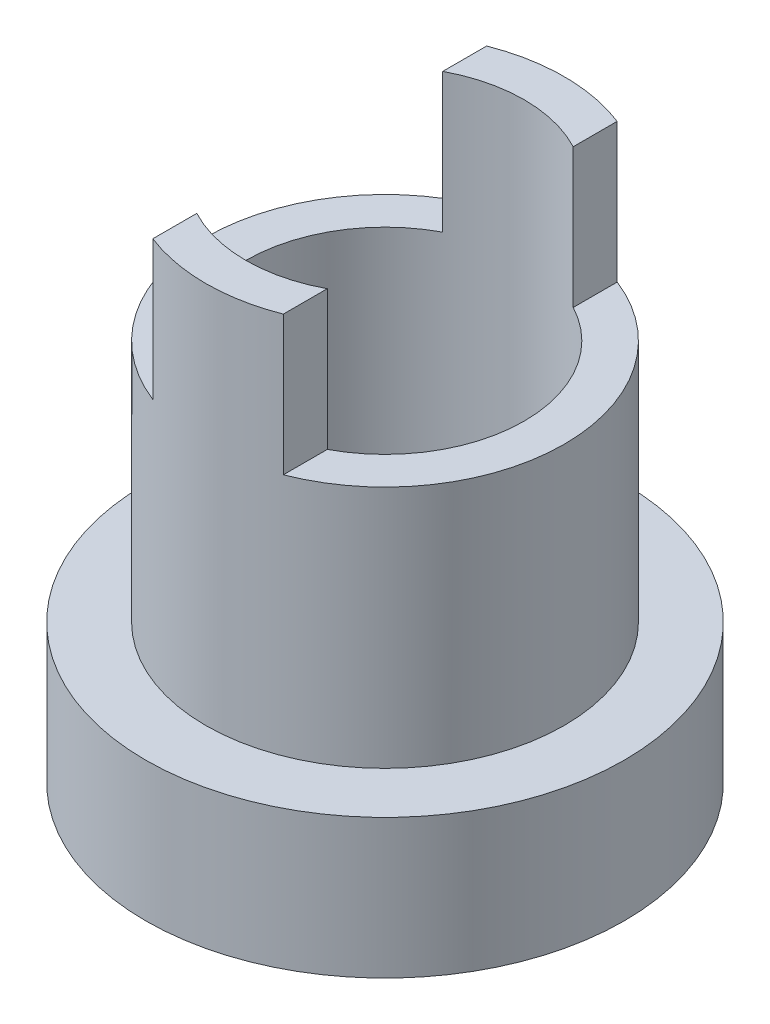
ISO-10303-21;
HEADER;
FILE_DESCRIPTION(('STEP AP214'),'2;1');
FILE_NAME('part.step','',(''),(''),'','','');
FILE_SCHEMA(('AUTOMOTIVE_DESIGN { 1 0 10303 214 1 1 1 1 }'));
ENDSEC;
DATA;
#1=APPLICATION_CONTEXT('core data for automotive mechanical design processes');
#2=APPLICATION_PROTOCOL_DEFINITION('international standard','automotive_design',2000,#1);
#3=PRODUCT_CONTEXT('',#1,'mechanical');
#4=PRODUCT('Part','Part','',(#3));
#5=PRODUCT_RELATED_PRODUCT_CATEGORY('part','',(#4));
#6=PRODUCT_DEFINITION_FORMATION('','',#4);
#7=PRODUCT_DEFINITION_CONTEXT('part definition',#1,'design');
#8=PRODUCT_DEFINITION('design','',#6,#7);
#9=PRODUCT_DEFINITION_SHAPE('','',#8);
#10=(LENGTH_UNIT() NAMED_UNIT(*) SI_UNIT(.MILLI.,.METRE.));
#11=(NAMED_UNIT(*) PLANE_ANGLE_UNIT() SI_UNIT($,.RADIAN.));
#12=(NAMED_UNIT(*) SI_UNIT($,.STERADIAN.) SOLID_ANGLE_UNIT());
#13=UNCERTAINTY_MEASURE_WITH_UNIT(LENGTH_MEASURE(1.E-05),#10,'distance_accuracy_value','');
#14=(GEOMETRIC_REPRESENTATION_CONTEXT(3) GLOBAL_UNCERTAINTY_ASSIGNED_CONTEXT((#13)) GLOBAL_UNIT_ASSIGNED_CONTEXT((#10,
#11,#12)) REPRESENTATION_CONTEXT('',''));
#15=CARTESIAN_POINT('',(0.,0.,0.));
#16=DIRECTION('',(0.,0.,1.));
#17=DIRECTION('',(1.,0.,0.));
#18=AXIS2_PLACEMENT_3D('',#15,#16,#17);
#19=CARTESIAN_POINT('',(0.,4.,0.));
#20=DIRECTION('',(0.,1.,0.));
#21=DIRECTION('',(0.,0.,1.));
#22=AXIS2_PLACEMENT_3D('',#19,#20,#21);
#23=PLANE('',#22);
#24=CARTESIAN_POINT('',(0.,4.,0.));
#25=DIRECTION('',(0.,1.,0.));
#26=DIRECTION('',(0.,0.,1.));
#27=AXIS2_PLACEMENT_3D('',#24,#25,#26);
#28=CIRCLE('',#27,5.15);
#29=CARTESIAN_POINT('',(0.,4.,5.15));
#30=VERTEX_POINT('',#29);
#31=EDGE_CURVE('E19',#30,#30,#28,.T.);
#32=ORIENTED_EDGE('',*,*,#31,.F.);
#33=EDGE_LOOP('',(#32));
#34=FACE_BOUND('',#33,.T.);
#35=CARTESIAN_POINT('',(0.,4.,0.));
#36=DIRECTION('',(0.,1.,0.));
#37=DIRECTION('',(0.,0.,1.));
#38=AXIS2_PLACEMENT_3D('',#35,#36,#37);
#39=CIRCLE('',#38,6.875);
#40=CARTESIAN_POINT('',(0.,4.,6.875));
#41=VERTEX_POINT('',#40);
#42=EDGE_CURVE('E89',#41,#41,#39,.F.);
#43=ORIENTED_EDGE('',*,*,#42,.F.);
#44=EDGE_LOOP('',(#43));
#45=FACE_BOUND('',#44,.T.);
#46=ADVANCED_FACE('F16',(#34,#45),#23,.T.);
#47=CARTESIAN_POINT('',(0.,4.,0.));
#48=DIRECTION('',(0.,1.,0.));
#49=DIRECTION('',(0.,0.,1.));
#50=AXIS2_PLACEMENT_3D('',#47,#48,#49);
#51=CYLINDRICAL_SURFACE('',#50,5.15);
#52=ORIENTED_EDGE('',*,*,#31,.T.);
#53=EDGE_LOOP('',(#52));
#54=FACE_BOUND('',#53,.T.);
#55=DIRECTION('',(0.,1.,0.));
#56=VECTOR('',#55,1.);
#57=CARTESIAN_POINT('',(1.875,13.,4.7965482380562));
#58=LINE('',#57,#56);
#59=CARTESIAN_POINT('',(1.875,15.,4.7965482380562));
#60=VERTEX_POINT('',#59);
#61=CARTESIAN_POINT('',(1.875,11.,4.7965482380562));
#62=VERTEX_POINT('',#61);
#63=EDGE_CURVE('E106',#60,#62,#58,.F.);
#64=ORIENTED_EDGE('',*,*,#63,.F.);
#65=CARTESIAN_POINT('',(0.,15.,0.));
#66=DIRECTION('',(0.,1.,0.));
#67=DIRECTION('',(0.,0.,1.));
#68=AXIS2_PLACEMENT_3D('',#65,#66,#67);
#69=CIRCLE('',#68,5.15);
#70=CARTESIAN_POINT('',(-1.875,15.,4.7965482380562));
#71=VERTEX_POINT('',#70);
#72=EDGE_CURVE('E97',#71,#60,#69,.T.);
#73=ORIENTED_EDGE('',*,*,#72,.F.);
#74=DIRECTION('',(0.,1.,0.));
#75=VECTOR('',#74,1.);
#76=CARTESIAN_POINT('',(-1.875,13.,4.7965482380562));
#77=LINE('',#76,#75);
#78=CARTESIAN_POINT('',(-1.875,11.,4.7965482380562));
#79=VERTEX_POINT('',#78);
#80=EDGE_CURVE('E92',#71,#79,#77,.F.);
#81=ORIENTED_EDGE('',*,*,#80,.T.);
#82=CARTESIAN_POINT('',(0.,11.,0.));
#83=DIRECTION('',(0.,1.,0.));
#84=DIRECTION('',(0.,0.,1.));
#85=AXIS2_PLACEMENT_3D('',#82,#83,#84);
#86=CIRCLE('',#85,5.15);
#87=CARTESIAN_POINT('',(-1.875,11.,-4.7965482380562));
#88=VERTEX_POINT('',#87);
#89=EDGE_CURVE('E80',#79,#88,#86,.F.);
#90=ORIENTED_EDGE('',*,*,#89,.T.);
#91=DIRECTION('',(0.,1.,0.));
#92=VECTOR('',#91,1.);
#93=CARTESIAN_POINT('',(-1.875,13.,-4.7965482380562));
#94=LINE('',#93,#92);
#95=CARTESIAN_POINT('',(-1.875,15.,-4.7965482380562));
#96=VERTEX_POINT('',#95);
#97=EDGE_CURVE('E114',#88,#96,#94,.T.);
#98=ORIENTED_EDGE('',*,*,#97,.T.);
#99=CARTESIAN_POINT('',(0.,15.,0.));
#100=DIRECTION('',(0.,1.,0.));
#101=DIRECTION('',(0.,0.,1.));
#102=AXIS2_PLACEMENT_3D('',#99,#100,#101);
#103=CIRCLE('',#102,5.15);
#104=CARTESIAN_POINT('',(1.875,15.,-4.7965482380562));
#105=VERTEX_POINT('',#104);
#106=EDGE_CURVE('E113',#105,#96,#103,.T.);
#107=ORIENTED_EDGE('',*,*,#106,.F.);
#108=DIRECTION('',(0.,1.,0.));
#109=VECTOR('',#108,1.);
#110=CARTESIAN_POINT('',(1.875,13.,-4.7965482380562));
#111=LINE('',#110,#109);
#112=CARTESIAN_POINT('',(1.875,11.,-4.7965482380562));
#113=VERTEX_POINT('',#112);
#114=EDGE_CURVE('E110',#113,#105,#111,.T.);
#115=ORIENTED_EDGE('',*,*,#114,.F.);
#116=CARTESIAN_POINT('',(0.,11.,0.));
#117=DIRECTION('',(0.,1.,0.));
#118=DIRECTION('',(0.,0.,1.));
#119=AXIS2_PLACEMENT_3D('',#116,#117,#118);
#120=CIRCLE('',#119,5.15);
#121=EDGE_CURVE('E109',#113,#62,#120,.F.);
#122=ORIENTED_EDGE('',*,*,#121,.T.);
#123=EDGE_LOOP('',(#64,#73,#81,#90,#98,#107,#115,#122));
#124=FACE_BOUND('',#123,.T.);
#125=ADVANCED_FACE('F96',(#54,#124),#51,.T.);
#126=CARTESIAN_POINT('',(0.,0.,0.));
#127=DIRECTION('',(0.,1.,0.));
#128=DIRECTION('',(0.,0.,1.));
#129=AXIS2_PLACEMENT_3D('',#126,#127,#128);
#130=CYLINDRICAL_SURFACE('',#129,6.875);
#131=CARTESIAN_POINT('',(0.,0.,0.));
#132=DIRECTION('',(0.,1.,0.));
#133=DIRECTION('',(0.,0.,1.));
#134=AXIS2_PLACEMENT_3D('',#131,#132,#133);
#135=CIRCLE('',#134,6.875);
#136=CARTESIAN_POINT('',(0.,0.,6.875));
#137=VERTEX_POINT('',#136);
#138=EDGE_CURVE('E98',#137,#137,#135,.T.);
#139=ORIENTED_EDGE('',*,*,#138,.T.);
#140=EDGE_LOOP('',(#139));
#141=FACE_BOUND('',#140,.T.);
#142=ORIENTED_EDGE('',*,*,#42,.T.);
#143=EDGE_LOOP('',(#142));
#144=FACE_BOUND('',#143,.T.);
#145=ADVANCED_FACE('F148',(#141,#144),#130,.T.);
#146=CARTESIAN_POINT('',(-1.875,11.,-6.23674060833547));
#147=DIRECTION('',(0.,-1.,0.));
#148=DIRECTION('',(0.,0.,-1.));
#149=AXIS2_PLACEMENT_3D('',#146,#147,#148);
#150=PLANE('',#149);
#151=DIRECTION('',(0.,0.,-1.));
#152=VECTOR('',#151,1.);
#153=CARTESIAN_POINT('',(-1.875,11.,-0.0726574679316326));
#154=LINE('',#153,#152);
#155=CARTESIAN_POINT('',(-1.875,11.,3.53332350627564));
#156=VERTEX_POINT('',#155);
#157=EDGE_CURVE('E84',#79,#156,#154,.T.);
#158=ORIENTED_EDGE('',*,*,#157,.T.);
#159=CARTESIAN_POINT('',(0.,11.,0.));
#160=DIRECTION('',(0.,1.,0.));
#161=DIRECTION('',(0.,0.,1.));
#162=AXIS2_PLACEMENT_3D('',#159,#160,#161);
#163=CIRCLE('',#162,4.);
#164=CARTESIAN_POINT('',(-1.875,11.,-3.53332350627564));
#165=VERTEX_POINT('',#164);
#166=EDGE_CURVE('E101',#156,#165,#163,.F.);
#167=ORIENTED_EDGE('',*,*,#166,.T.);
#168=DIRECTION('',(0.,0.,-1.));
#169=VECTOR('',#168,1.);
#170=CARTESIAN_POINT('',(-1.875,11.,-0.0726574679316326));
#171=LINE('',#170,#169);
#172=EDGE_CURVE('E85',#165,#88,#171,.T.);
#173=ORIENTED_EDGE('',*,*,#172,.T.);
#174=ORIENTED_EDGE('',*,*,#89,.F.);
#175=EDGE_LOOP('',(#158,#167,#173,#174));
#176=FACE_BOUND('',#175,.T.);
#177=ADVANCED_FACE('F82',(#176),#150,.F.);
#178=CARTESIAN_POINT('',(-1.875,13.,-0.0726574679316326));
#179=DIRECTION('',(1.,0.,0.));
#180=DIRECTION('',(0.,0.,-1.));
#181=AXIS2_PLACEMENT_3D('',#178,#179,#180);
#182=PLANE('',#181);
#183=ORIENTED_EDGE('',*,*,#172,.F.);
#184=DIRECTION('',(0.,1.,0.));
#185=VECTOR('',#184,1.);
#186=CARTESIAN_POINT('',(-1.875,0.,-3.53332350627564));
#187=LINE('',#186,#185);
#188=CARTESIAN_POINT('',(-1.875,15.,-3.53332350627564));
#189=VERTEX_POINT('',#188);
#190=EDGE_CURVE('E128',#165,#189,#187,.T.);
#191=ORIENTED_EDGE('',*,*,#190,.T.);
#192=DIRECTION('',(0.,0.,1.));
#193=VECTOR('',#192,1.);
#194=CARTESIAN_POINT('',(-1.875,15.,0.));
#195=LINE('',#194,#193);
#196=EDGE_CURVE('E115',#96,#189,#195,.T.);
#197=ORIENTED_EDGE('',*,*,#196,.F.);
#198=ORIENTED_EDGE('',*,*,#97,.F.);
#199=EDGE_LOOP('',(#183,#191,#197,#198));
#200=FACE_BOUND('',#199,.T.);
#201=ADVANCED_FACE('F183',(#200),#182,.F.);
#202=CARTESIAN_POINT('',(0.,15.,0.));
#203=DIRECTION('',(0.,1.,0.));
#204=DIRECTION('',(0.,0.,1.));
#205=AXIS2_PLACEMENT_3D('',#202,#203,#204);
#206=PLANE('',#205);
#207=DIRECTION('',(0.,0.,-1.));
#208=VECTOR('',#207,1.);
#209=CARTESIAN_POINT('',(1.875,15.,0.));
#210=LINE('',#209,#208);
#211=CARTESIAN_POINT('',(1.875,15.,-3.53332350627564));
#212=VERTEX_POINT('',#211);
#213=EDGE_CURVE('E112',#105,#212,#210,.F.);
#214=ORIENTED_EDGE('',*,*,#213,.F.);
#215=ORIENTED_EDGE('',*,*,#106,.T.);
#216=ORIENTED_EDGE('',*,*,#196,.T.);
#217=CARTESIAN_POINT('',(0.,15.,0.));
#218=DIRECTION('',(0.,1.,0.));
#219=DIRECTION('',(0.,0.,1.));
#220=AXIS2_PLACEMENT_3D('',#217,#218,#219);
#221=CIRCLE('',#220,4.);
#222=EDGE_CURVE('E125',#189,#212,#221,.F.);
#223=ORIENTED_EDGE('',*,*,#222,.T.);
#224=EDGE_LOOP('',(#214,#215,#216,#223));
#225=FACE_BOUND('',#224,.T.);
#226=ADVANCED_FACE('F179',(#225),#206,.T.);
#227=CARTESIAN_POINT('',(1.875,13.,0.));
#228=DIRECTION('',(1.,0.,0.));
#229=DIRECTION('',(0.,0.,-1.));
#230=AXIS2_PLACEMENT_3D('',#227,#228,#229);
#231=PLANE('',#230);
#232=DIRECTION('',(0.,1.,0.));
#233=VECTOR('',#232,1.);
#234=CARTESIAN_POINT('',(1.875,0.,-3.53332350627564));
#235=LINE('',#234,#233);
#236=CARTESIAN_POINT('',(1.875,11.,-3.53332350627564));
#237=VERTEX_POINT('',#236);
#238=EDGE_CURVE('E124',#212,#237,#235,.F.);
#239=ORIENTED_EDGE('',*,*,#238,.T.);
#240=DIRECTION('',(0.,0.,-1.));
#241=VECTOR('',#240,1.);
#242=CARTESIAN_POINT('',(1.875,11.,5.15));
#243=LINE('',#242,#241);
#244=EDGE_CURVE('E133',#237,#113,#243,.T.);
#245=ORIENTED_EDGE('',*,*,#244,.T.);
#246=ORIENTED_EDGE('',*,*,#114,.T.);
#247=ORIENTED_EDGE('',*,*,#213,.T.);
#248=EDGE_LOOP('',(#239,#245,#246,#247));
#249=FACE_BOUND('',#248,.T.);
#250=ADVANCED_FACE('F175',(#249),#231,.T.);
#251=CARTESIAN_POINT('',(1.875,11.,5.15));
#252=DIRECTION('',(0.,-1.,0.));
#253=DIRECTION('',(0.,0.,-1.));
#254=AXIS2_PLACEMENT_3D('',#251,#252,#253);
#255=PLANE('',#254);
#256=ORIENTED_EDGE('',*,*,#244,.F.);
#257=CARTESIAN_POINT('',(0.,11.,0.));
#258=DIRECTION('',(0.,1.,0.));
#259=DIRECTION('',(0.,0.,1.));
#260=AXIS2_PLACEMENT_3D('',#257,#258,#259);
#261=CIRCLE('',#260,4.);
#262=CARTESIAN_POINT('',(1.875,11.,3.53332350627564));
#263=VERTEX_POINT('',#262);
#264=EDGE_CURVE('E121',#237,#263,#261,.F.);
#265=ORIENTED_EDGE('',*,*,#264,.T.);
#266=DIRECTION('',(0.,0.,-1.));
#267=VECTOR('',#266,1.);
#268=CARTESIAN_POINT('',(1.875,11.,0.));
#269=LINE('',#268,#267);
#270=EDGE_CURVE('E108',#62,#263,#269,.T.);
#271=ORIENTED_EDGE('',*,*,#270,.F.);
#272=ORIENTED_EDGE('',*,*,#121,.F.);
#273=EDGE_LOOP('',(#256,#265,#271,#272));
#274=FACE_BOUND('',#273,.T.);
#275=ADVANCED_FACE('F171',(#274),#255,.F.);
#276=CARTESIAN_POINT('',(1.875,13.,0.));
#277=DIRECTION('',(1.,0.,0.));
#278=DIRECTION('',(0.,0.,-1.));
#279=AXIS2_PLACEMENT_3D('',#276,#277,#278);
#280=PLANE('',#279);
#281=DIRECTION('',(0.,1.,0.));
#282=VECTOR('',#281,1.);
#283=CARTESIAN_POINT('',(1.875,0.,3.53332350627564));
#284=LINE('',#283,#282);
#285=CARTESIAN_POINT('',(1.875,15.,3.53332350627564));
#286=VERTEX_POINT('',#285);
#287=EDGE_CURVE('E120',#263,#286,#284,.T.);
#288=ORIENTED_EDGE('',*,*,#287,.T.);
#289=DIRECTION('',(0.,0.,1.));
#290=VECTOR('',#289,1.);
#291=CARTESIAN_POINT('',(1.875,15.,0.));
#292=LINE('',#291,#290);
#293=EDGE_CURVE('E93',#60,#286,#292,.F.);
#294=ORIENTED_EDGE('',*,*,#293,.F.);
#295=ORIENTED_EDGE('',*,*,#63,.T.);
#296=ORIENTED_EDGE('',*,*,#270,.T.);
#297=EDGE_LOOP('',(#288,#294,#295,#296));
#298=FACE_BOUND('',#297,.T.);
#299=ADVANCED_FACE('F167',(#298),#280,.T.);
#300=CARTESIAN_POINT('',(0.,15.,0.));
#301=DIRECTION('',(0.,1.,0.));
#302=DIRECTION('',(0.,0.,1.));
#303=AXIS2_PLACEMENT_3D('',#300,#301,#302);
#304=PLANE('',#303);
#305=ORIENTED_EDGE('',*,*,#293,.T.);
#306=CARTESIAN_POINT('',(0.,15.,0.));
#307=DIRECTION('',(0.,1.,0.));
#308=DIRECTION('',(0.,0.,1.));
#309=AXIS2_PLACEMENT_3D('',#306,#307,#308);
#310=CIRCLE('',#309,4.);
#311=CARTESIAN_POINT('',(-1.875,15.,3.53332350627564));
#312=VERTEX_POINT('',#311);
#313=EDGE_CURVE('E117',#286,#312,#310,.F.);
#314=ORIENTED_EDGE('',*,*,#313,.T.);
#315=DIRECTION('',(0.,0.,-1.));
#316=VECTOR('',#315,1.);
#317=CARTESIAN_POINT('',(-1.875,15.,-0.0726574679316326));
#318=LINE('',#317,#316);
#319=EDGE_CURVE('E34',#312,#71,#318,.F.);
#320=ORIENTED_EDGE('',*,*,#319,.T.);
#321=ORIENTED_EDGE('',*,*,#72,.T.);
#322=EDGE_LOOP('',(#305,#314,#320,#321));
#323=FACE_BOUND('',#322,.T.);
#324=ADVANCED_FACE('F164',(#323),#304,.T.);
#325=CARTESIAN_POINT('',(-1.875,13.,-0.0726574679316326));
#326=DIRECTION('',(1.,0.,0.));
#327=DIRECTION('',(0.,0.,-1.));
#328=AXIS2_PLACEMENT_3D('',#325,#326,#327);
#329=PLANE('',#328);
#330=ORIENTED_EDGE('',*,*,#319,.F.);
#331=DIRECTION('',(0.,1.,0.));
#332=VECTOR('',#331,1.);
#333=CARTESIAN_POINT('',(-1.875,0.,3.53332350627564));
#334=LINE('',#333,#332);
#335=EDGE_CURVE('E25',#312,#156,#334,.F.);
#336=ORIENTED_EDGE('',*,*,#335,.T.);
#337=ORIENTED_EDGE('',*,*,#157,.F.);
#338=ORIENTED_EDGE('',*,*,#80,.F.);
#339=EDGE_LOOP('',(#330,#336,#337,#338));
#340=FACE_BOUND('',#339,.T.);
#341=ADVANCED_FACE('F91',(#340),#329,.F.);
#342=CARTESIAN_POINT('',(0.,0.,0.));
#343=DIRECTION('',(0.,1.,0.));
#344=DIRECTION('',(0.,0.,1.));
#345=AXIS2_PLACEMENT_3D('',#342,#343,#344);
#346=PLANE('',#345);
#347=CARTESIAN_POINT('',(0.,0.,0.));
#348=DIRECTION('',(0.,1.,0.));
#349=DIRECTION('',(0.,0.,1.));
#350=AXIS2_PLACEMENT_3D('',#347,#348,#349);
#351=CIRCLE('',#350,4.);
#352=CARTESIAN_POINT('',(0.,0.,4.));
#353=VERTEX_POINT('',#352);
#354=EDGE_CURVE('E11',#353,#353,#351,.T.);
#355=ORIENTED_EDGE('',*,*,#354,.T.);
#356=EDGE_LOOP('',(#355));
#357=FACE_BOUND('',#356,.T.);
#358=ORIENTED_EDGE('',*,*,#138,.F.);
#359=EDGE_LOOP('',(#358));
#360=FACE_BOUND('',#359,.T.);
#361=ADVANCED_FACE('F151',(#357,#360),#346,.F.);
#362=CARTESIAN_POINT('',(0.,0.,0.));
#363=DIRECTION('',(0.,1.,0.));
#364=DIRECTION('',(0.,0.,1.));
#365=AXIS2_PLACEMENT_3D('',#362,#363,#364);
#366=CYLINDRICAL_SURFACE('',#365,4.);
#367=ORIENTED_EDGE('',*,*,#354,.F.);
#368=EDGE_LOOP('',(#367));
#369=FACE_BOUND('',#368,.T.);
#370=ORIENTED_EDGE('',*,*,#313,.F.);
#371=ORIENTED_EDGE('',*,*,#287,.F.);
#372=ORIENTED_EDGE('',*,*,#264,.F.);
#373=ORIENTED_EDGE('',*,*,#238,.F.);
#374=ORIENTED_EDGE('',*,*,#222,.F.);
#375=ORIENTED_EDGE('',*,*,#190,.F.);
#376=ORIENTED_EDGE('',*,*,#166,.F.);
#377=ORIENTED_EDGE('',*,*,#335,.F.);
#378=EDGE_LOOP('',(#370,#371,#372,#373,#374,#375,#376,#377));
#379=FACE_BOUND('',#378,.T.);
#380=ADVANCED_FACE('F149',(#369,#379),#366,.F.);
#381=CLOSED_SHELL('',(#46,#125,#145,#177,#201,#226,#250,#275,#299,#324,#341,#361,#380));
#382=MANIFOLD_SOLID_BREP('B1',#381);
#383=ADVANCED_BREP_SHAPE_REPRESENTATION('',(#18,#382),#14);
#384=SHAPE_DEFINITION_REPRESENTATION(#9,#383);
ENDSEC;
END-ISO-10303-21;
